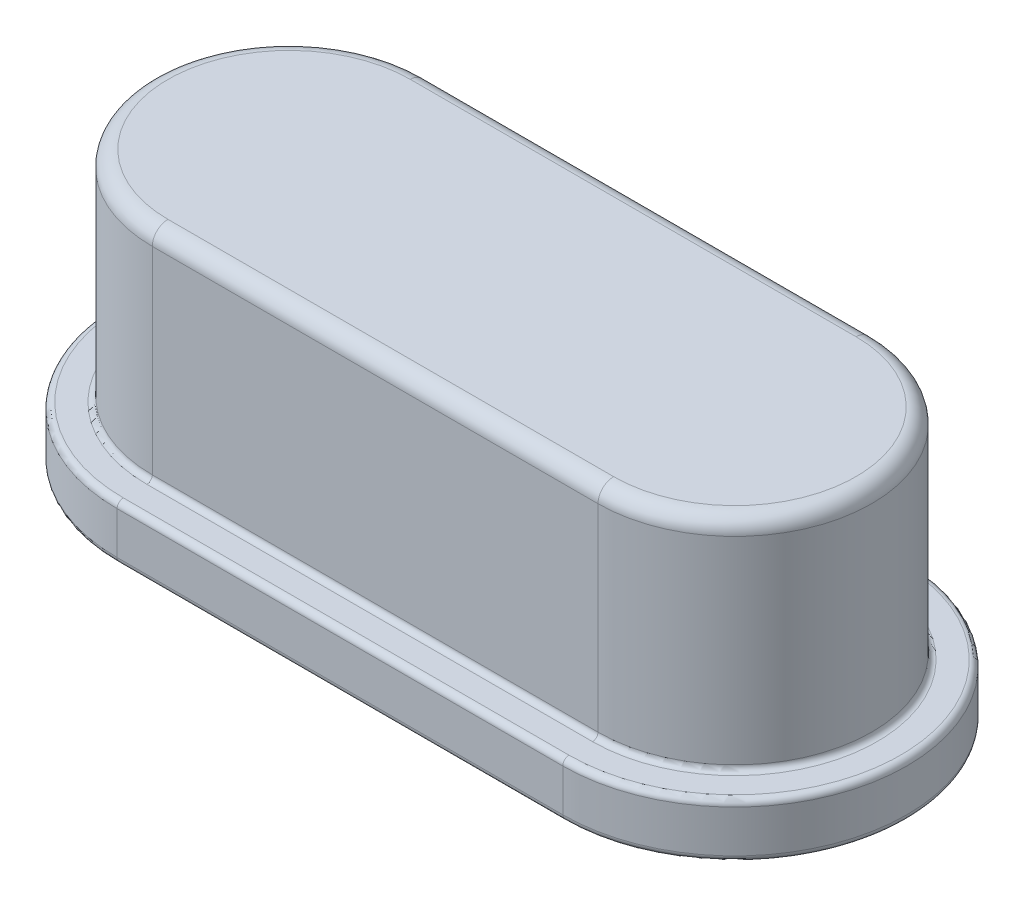
ISO-10303-21;
HEADER;
FILE_DESCRIPTION(('STEP AP214'),'2;1');
FILE_NAME('part.step','',(''),(''),'','','');
FILE_SCHEMA(('AUTOMOTIVE_DESIGN { 1 0 10303 214 1 1 1 1 }'));
ENDSEC;
DATA;
#1=APPLICATION_CONTEXT('core data for automotive mechanical design processes');
#2=APPLICATION_PROTOCOL_DEFINITION('international standard','automotive_design',2000,#1);
#3=PRODUCT_CONTEXT('',#1,'mechanical');
#4=PRODUCT('Part','Part','',(#3));
#5=PRODUCT_RELATED_PRODUCT_CATEGORY('part','',(#4));
#6=PRODUCT_DEFINITION_FORMATION('','',#4);
#7=PRODUCT_DEFINITION_CONTEXT('part definition',#1,'design');
#8=PRODUCT_DEFINITION('design','',#6,#7);
#9=PRODUCT_DEFINITION_SHAPE('','',#8);
#10=(LENGTH_UNIT() NAMED_UNIT(*) SI_UNIT(.MILLI.,.METRE.));
#11=(NAMED_UNIT(*) PLANE_ANGLE_UNIT() SI_UNIT($,.RADIAN.));
#12=(NAMED_UNIT(*) SI_UNIT($,.STERADIAN.) SOLID_ANGLE_UNIT());
#13=UNCERTAINTY_MEASURE_WITH_UNIT(LENGTH_MEASURE(1.E-05),#10,'distance_accuracy_value','');
#14=(GEOMETRIC_REPRESENTATION_CONTEXT(3) GLOBAL_UNCERTAINTY_ASSIGNED_CONTEXT((#13)) GLOBAL_UNIT_ASSIGNED_CONTEXT((#10,
#11,#12)) REPRESENTATION_CONTEXT('',''));
#15=CARTESIAN_POINT('',(0.,0.,0.));
#16=DIRECTION('',(0.,0.,1.));
#17=DIRECTION('',(1.,0.,0.));
#18=AXIS2_PLACEMENT_3D('',#15,#16,#17);
#19=CARTESIAN_POINT('',(-2.85,0.7,0.));
#20=DIRECTION('',(0.,-1.,0.));
#21=DIRECTION('',(0.,0.,-1.));
#22=AXIS2_PLACEMENT_3D('',#19,#20,#21);
#23=CYLINDRICAL_SURFACE('',#22,2.2);
#24=DIRECTION('',(0.,-1.,0.));
#25=VECTOR('',#24,1.);
#26=CARTESIAN_POINT('',(-2.85,0.7,-2.2));
#27=LINE('',#26,#25);
#28=CARTESIAN_POINT('',(-2.85,0.62,-2.2));
#29=VERTEX_POINT('',#28);
#30=CARTESIAN_POINT('',(-2.85,0.08,-2.2));
#31=VERTEX_POINT('',#30);
#32=EDGE_CURVE('E306',#29,#31,#27,.T.);
#33=ORIENTED_EDGE('',*,*,#32,.T.);
#34=CARTESIAN_POINT('',(-2.85,0.08,0.));
#35=DIRECTION('',(0.,1.,0.));
#36=DIRECTION('',(0.,0.,1.));
#37=AXIS2_PLACEMENT_3D('',#34,#35,#36);
#38=CIRCLE('',#37,2.2);
#39=CARTESIAN_POINT('',(-2.85,0.08,2.2));
#40=VERTEX_POINT('',#39);
#41=EDGE_CURVE('E206',#31,#40,#38,.T.);
#42=ORIENTED_EDGE('',*,*,#41,.T.);
#43=DIRECTION('',(0.,-1.,0.));
#44=VECTOR('',#43,1.);
#45=CARTESIAN_POINT('',(-2.85,0.7,2.2));
#46=LINE('',#45,#44);
#47=CARTESIAN_POINT('',(-2.85,0.62,2.2));
#48=VERTEX_POINT('',#47);
#49=EDGE_CURVE('E180',#48,#40,#46,.T.);
#50=ORIENTED_EDGE('',*,*,#49,.F.);
#51=CARTESIAN_POINT('',(-2.85,0.62,0.));
#52=DIRECTION('',(0.,1.,0.));
#53=DIRECTION('',(0.,0.,1.));
#54=AXIS2_PLACEMENT_3D('',#51,#52,#53);
#55=CIRCLE('',#54,2.2);
#56=EDGE_CURVE('E196',#48,#29,#55,.F.);
#57=ORIENTED_EDGE('',*,*,#56,.T.);
#58=EDGE_LOOP('',(#33,#42,#50,#57));
#59=FACE_BOUND('',#58,.T.);
#60=ADVANCED_FACE('F44',(#59),#23,.T.);
#61=CARTESIAN_POINT('',(-2.85,0.7,2.2));
#62=DIRECTION('',(0.,0.,-1.));
#63=DIRECTION('',(-1.,0.,0.));
#64=AXIS2_PLACEMENT_3D('',#61,#62,#63);
#65=PLANE('',#64);
#66=ORIENTED_EDGE('',*,*,#49,.T.);
#67=DIRECTION('',(1.,0.,0.));
#68=VECTOR('',#67,1.);
#69=CARTESIAN_POINT('',(-2.85,0.08,2.2));
#70=LINE('',#69,#68);
#71=CARTESIAN_POINT('',(2.85,0.08,2.2));
#72=VERTEX_POINT('',#71);
#73=EDGE_CURVE('E237',#40,#72,#70,.T.);
#74=ORIENTED_EDGE('',*,*,#73,.T.);
#75=DIRECTION('',(0.,-1.,0.));
#76=VECTOR('',#75,1.);
#77=CARTESIAN_POINT('',(2.85,0.7,2.2));
#78=LINE('',#77,#76);
#79=CARTESIAN_POINT('',(2.85,0.62,2.2));
#80=VERTEX_POINT('',#79);
#81=EDGE_CURVE('E318',#80,#72,#78,.T.);
#82=ORIENTED_EDGE('',*,*,#81,.F.);
#83=DIRECTION('',(1.,0.,0.));
#84=VECTOR('',#83,1.);
#85=CARTESIAN_POINT('',(-2.85,0.62,2.2));
#86=LINE('',#85,#84);
#87=EDGE_CURVE('E235',#80,#48,#86,.F.);
#88=ORIENTED_EDGE('',*,*,#87,.T.);
#89=EDGE_LOOP('',(#66,#74,#82,#88));
#90=FACE_BOUND('',#89,.T.);
#91=ADVANCED_FACE('F342',(#90),#65,.F.);
#92=CARTESIAN_POINT('',(2.85,0.7,0.));
#93=DIRECTION('',(0.,-1.,0.));
#94=DIRECTION('',(0.,0.,-1.));
#95=AXIS2_PLACEMENT_3D('',#92,#93,#94);
#96=CYLINDRICAL_SURFACE('',#95,2.2);
#97=ORIENTED_EDGE('',*,*,#81,.T.);
#98=CARTESIAN_POINT('',(2.85,0.08,0.));
#99=DIRECTION('',(0.,1.,0.));
#100=DIRECTION('',(0.,0.,1.));
#101=AXIS2_PLACEMENT_3D('',#98,#99,#100);
#102=CIRCLE('',#101,2.2);
#103=CARTESIAN_POINT('',(2.85,0.08,-2.2));
#104=VERTEX_POINT('',#103);
#105=EDGE_CURVE('E224',#72,#104,#102,.T.);
#106=ORIENTED_EDGE('',*,*,#105,.T.);
#107=DIRECTION('',(0.,-1.,0.));
#108=VECTOR('',#107,1.);
#109=CARTESIAN_POINT('',(2.85,0.7,-2.2));
#110=LINE('',#109,#108);
#111=CARTESIAN_POINT('',(2.85,0.62,-2.2));
#112=VERTEX_POINT('',#111);
#113=EDGE_CURVE('E310',#112,#104,#110,.T.);
#114=ORIENTED_EDGE('',*,*,#113,.F.);
#115=CARTESIAN_POINT('',(2.85,0.62,0.));
#116=DIRECTION('',(0.,1.,0.));
#117=DIRECTION('',(0.,0.,1.));
#118=AXIS2_PLACEMENT_3D('',#115,#116,#117);
#119=CIRCLE('',#118,2.2);
#120=EDGE_CURVE('E222',#112,#80,#119,.F.);
#121=ORIENTED_EDGE('',*,*,#120,.T.);
#122=EDGE_LOOP('',(#97,#106,#114,#121));
#123=FACE_BOUND('',#122,.T.);
#124=ADVANCED_FACE('F348',(#123),#96,.T.);
#125=CARTESIAN_POINT('',(-2.85,0.7,-2.2));
#126=DIRECTION('',(0.,0.,1.));
#127=DIRECTION('',(1.,0.,0.));
#128=AXIS2_PLACEMENT_3D('',#125,#126,#127);
#129=PLANE('',#128);
#130=ORIENTED_EDGE('',*,*,#113,.T.);
#131=DIRECTION('',(-1.,0.,0.));
#132=VECTOR('',#131,1.);
#133=CARTESIAN_POINT('',(-2.85,0.08,-2.2));
#134=LINE('',#133,#132);
#135=EDGE_CURVE('E220',#104,#31,#134,.T.);
#136=ORIENTED_EDGE('',*,*,#135,.T.);
#137=ORIENTED_EDGE('',*,*,#32,.F.);
#138=DIRECTION('',(-1.,0.,0.));
#139=VECTOR('',#138,1.);
#140=CARTESIAN_POINT('',(2.85,0.62,-2.2));
#141=LINE('',#140,#139);
#142=EDGE_CURVE('E218',#29,#112,#141,.F.);
#143=ORIENTED_EDGE('',*,*,#142,.T.);
#144=EDGE_LOOP('',(#130,#136,#137,#143));
#145=FACE_BOUND('',#144,.T.);
#146=ADVANCED_FACE('F490',(#145),#129,.F.);
#147=CARTESIAN_POINT('',(-2.85,0.7,0.));
#148=DIRECTION('',(0.,1.,0.));
#149=DIRECTION('',(0.,0.,1.));
#150=AXIS2_PLACEMENT_3D('',#147,#148,#149);
#151=PLANE('',#150);
#152=DIRECTION('',(1.,0.,0.));
#153=VECTOR('',#152,1.);
#154=CARTESIAN_POINT('',(-2.85,0.7,1.82));
#155=LINE('',#154,#153);
#156=CARTESIAN_POINT('',(2.85,0.7,1.82));
#157=VERTEX_POINT('',#156);
#158=CARTESIAN_POINT('',(-2.85,0.7,1.82));
#159=VERTEX_POINT('',#158);
#160=EDGE_CURVE('E261',#157,#159,#155,.F.);
#161=ORIENTED_EDGE('',*,*,#160,.T.);
#162=CARTESIAN_POINT('',(-2.85,0.7,0.));
#163=DIRECTION('',(0.,1.,0.));
#164=DIRECTION('',(0.,0.,1.));
#165=AXIS2_PLACEMENT_3D('',#162,#163,#164);
#166=CIRCLE('',#165,1.82);
#167=CARTESIAN_POINT('',(-2.85,0.7,-1.82));
#168=VERTEX_POINT('',#167);
#169=EDGE_CURVE('E267',#159,#168,#166,.F.);
#170=ORIENTED_EDGE('',*,*,#169,.T.);
#171=DIRECTION('',(-1.,0.,0.));
#172=VECTOR('',#171,1.);
#173=CARTESIAN_POINT('',(-2.85,0.7,-1.82));
#174=LINE('',#173,#172);
#175=CARTESIAN_POINT('',(2.85,0.7,-1.82));
#176=VERTEX_POINT('',#175);
#177=EDGE_CURVE('E265',#168,#176,#174,.F.);
#178=ORIENTED_EDGE('',*,*,#177,.T.);
#179=CARTESIAN_POINT('',(2.85,0.7,0.));
#180=DIRECTION('',(0.,1.,0.));
#181=DIRECTION('',(0.,0.,1.));
#182=AXIS2_PLACEMENT_3D('',#179,#180,#181);
#183=CIRCLE('',#182,1.82);
#184=EDGE_CURVE('E263',#176,#157,#183,.F.);
#185=ORIENTED_EDGE('',*,*,#184,.T.);
#186=EDGE_LOOP('',(#161,#170,#178,#185));
#187=FACE_BOUND('',#186,.T.);
#188=DIRECTION('',(-1.,0.,0.));
#189=VECTOR('',#188,1.);
#190=CARTESIAN_POINT('',(-2.85,0.7,-2.12));
#191=LINE('',#190,#189);
#192=CARTESIAN_POINT('',(2.85,0.7,-2.12));
#193=VERTEX_POINT('',#192);
#194=CARTESIAN_POINT('',(-2.85,0.7,-2.12));
#195=VERTEX_POINT('',#194);
#196=EDGE_CURVE('E230',#193,#195,#191,.T.);
#197=ORIENTED_EDGE('',*,*,#196,.T.);
#198=CARTESIAN_POINT('',(-2.85,0.7,0.));
#199=DIRECTION('',(0.,1.,0.));
#200=DIRECTION('',(0.,0.,1.));
#201=AXIS2_PLACEMENT_3D('',#198,#199,#200);
#202=CIRCLE('',#201,2.12);
#203=CARTESIAN_POINT('',(-2.85,0.7,2.12));
#204=VERTEX_POINT('',#203);
#205=EDGE_CURVE('E232',#195,#204,#202,.T.);
#206=ORIENTED_EDGE('',*,*,#205,.T.);
#207=DIRECTION('',(1.,0.,0.));
#208=VECTOR('',#207,1.);
#209=CARTESIAN_POINT('',(2.85,0.7,2.12));
#210=LINE('',#209,#208);
#211=CARTESIAN_POINT('',(2.85,0.7,2.12));
#212=VERTEX_POINT('',#211);
#213=EDGE_CURVE('E226',#204,#212,#210,.T.);
#214=ORIENTED_EDGE('',*,*,#213,.T.);
#215=CARTESIAN_POINT('',(2.85,0.7,0.));
#216=DIRECTION('',(0.,1.,0.));
#217=DIRECTION('',(0.,0.,1.));
#218=AXIS2_PLACEMENT_3D('',#215,#216,#217);
#219=CIRCLE('',#218,2.12);
#220=EDGE_CURVE('E228',#212,#193,#219,.T.);
#221=ORIENTED_EDGE('',*,*,#220,.T.);
#222=EDGE_LOOP('',(#197,#206,#214,#221));
#223=FACE_BOUND('',#222,.T.);
#224=ADVANCED_FACE('F291',(#187,#223),#151,.T.);
#225=CARTESIAN_POINT('',(-2.85,0.,0.));
#226=DIRECTION('',(0.,1.,0.));
#227=DIRECTION('',(0.,0.,1.));
#228=AXIS2_PLACEMENT_3D('',#225,#226,#227);
#229=PLANE('',#228);
#230=DIRECTION('',(1.,0.,0.));
#231=VECTOR('',#230,1.);
#232=CARTESIAN_POINT('',(-2.85,0.,2.12));
#233=LINE('',#232,#231);
#234=CARTESIAN_POINT('',(2.85,0.,2.12));
#235=VERTEX_POINT('',#234);
#236=CARTESIAN_POINT('',(-2.85,0.,2.12));
#237=VERTEX_POINT('',#236);
#238=EDGE_CURVE('E209',#235,#237,#233,.F.);
#239=ORIENTED_EDGE('',*,*,#238,.T.);
#240=CARTESIAN_POINT('',(-2.85,0.,0.));
#241=DIRECTION('',(0.,1.,0.));
#242=DIRECTION('',(0.,0.,1.));
#243=AXIS2_PLACEMENT_3D('',#240,#241,#242);
#244=CIRCLE('',#243,2.12);
#245=CARTESIAN_POINT('',(-2.85,0.,-2.12));
#246=VERTEX_POINT('',#245);
#247=EDGE_CURVE('E215',#237,#246,#244,.F.);
#248=ORIENTED_EDGE('',*,*,#247,.T.);
#249=DIRECTION('',(-1.,0.,0.));
#250=VECTOR('',#249,1.);
#251=CARTESIAN_POINT('',(-2.85,0.,-2.12));
#252=LINE('',#251,#250);
#253=CARTESIAN_POINT('',(2.85,0.,-2.12));
#254=VERTEX_POINT('',#253);
#255=EDGE_CURVE('E213',#246,#254,#252,.F.);
#256=ORIENTED_EDGE('',*,*,#255,.T.);
#257=CARTESIAN_POINT('',(2.85,0.,0.));
#258=DIRECTION('',(0.,1.,0.));
#259=DIRECTION('',(0.,0.,1.));
#260=AXIS2_PLACEMENT_3D('',#257,#258,#259);
#261=CIRCLE('',#260,2.12);
#262=EDGE_CURVE('E211',#254,#235,#261,.F.);
#263=ORIENTED_EDGE('',*,*,#262,.T.);
#264=EDGE_LOOP('',(#239,#248,#256,#263));
#265=FACE_BOUND('',#264,.T.);
#266=ADVANCED_FACE('F480',(#265),#229,.F.);
#267=CARTESIAN_POINT('',(-2.85,3.5,0.));
#268=DIRECTION('',(0.,-1.,0.));
#269=DIRECTION('',(0.,0.,-1.));
#270=AXIS2_PLACEMENT_3D('',#267,#268,#269);
#271=CYLINDRICAL_SURFACE('',#270,1.75);
#272=DIRECTION('',(0.,-1.,0.));
#273=VECTOR('',#272,1.);
#274=CARTESIAN_POINT('',(-2.85,3.5,-1.75));
#275=LINE('',#274,#273);
#276=CARTESIAN_POINT('',(-2.85,3.3,-1.75));
#277=VERTEX_POINT('',#276);
#278=CARTESIAN_POINT('',(-2.85,0.77,-1.75));
#279=VERTEX_POINT('',#278);
#280=EDGE_CURVE('E203',#277,#279,#275,.T.);
#281=ORIENTED_EDGE('',*,*,#280,.T.);
#282=CARTESIAN_POINT('',(-2.85,0.77,0.));
#283=DIRECTION('',(0.,1.,0.));
#284=DIRECTION('',(0.,0.,1.));
#285=AXIS2_PLACEMENT_3D('',#282,#283,#284);
#286=CIRCLE('',#285,1.75);
#287=CARTESIAN_POINT('',(-2.85,0.77,1.75));
#288=VERTEX_POINT('',#287);
#289=EDGE_CURVE('E239',#279,#288,#286,.T.);
#290=ORIENTED_EDGE('',*,*,#289,.T.);
#291=DIRECTION('',(0.,-1.,0.));
#292=VECTOR('',#291,1.);
#293=CARTESIAN_POINT('',(-2.85,3.5,1.75));
#294=LINE('',#293,#292);
#295=CARTESIAN_POINT('',(-2.85,3.3,1.75));
#296=VERTEX_POINT('',#295);
#297=EDGE_CURVE('E303',#296,#288,#294,.T.);
#298=ORIENTED_EDGE('',*,*,#297,.F.);
#299=CARTESIAN_POINT('',(-2.85,3.3,0.));
#300=DIRECTION('',(0.,1.,0.));
#301=DIRECTION('',(0.,0.,1.));
#302=AXIS2_PLACEMENT_3D('',#299,#300,#301);
#303=CIRCLE('',#302,1.75);
#304=EDGE_CURVE('E166',#296,#277,#303,.F.);
#305=ORIENTED_EDGE('',*,*,#304,.T.);
#306=EDGE_LOOP('',(#281,#290,#298,#305));
#307=FACE_BOUND('',#306,.T.);
#308=ADVANCED_FACE('F302',(#307),#271,.T.);
#309=CARTESIAN_POINT('',(-2.85,3.5,1.75));
#310=DIRECTION('',(0.,0.,-1.));
#311=DIRECTION('',(-1.,0.,0.));
#312=AXIS2_PLACEMENT_3D('',#309,#310,#311);
#313=PLANE('',#312);
#314=ORIENTED_EDGE('',*,*,#297,.T.);
#315=DIRECTION('',(1.,0.,0.));
#316=VECTOR('',#315,1.);
#317=CARTESIAN_POINT('',(-2.85,0.77,1.75));
#318=LINE('',#317,#316);
#319=CARTESIAN_POINT('',(2.85,0.77,1.75));
#320=VERTEX_POINT('',#319);
#321=EDGE_CURVE('E13',#288,#320,#318,.T.);
#322=ORIENTED_EDGE('',*,*,#321,.T.);
#323=DIRECTION('',(0.,-1.,0.));
#324=VECTOR('',#323,1.);
#325=CARTESIAN_POINT('',(2.85,3.5,1.75));
#326=LINE('',#325,#324);
#327=CARTESIAN_POINT('',(2.85,3.3,1.75));
#328=VERTEX_POINT('',#327);
#329=EDGE_CURVE('E307',#328,#320,#326,.T.);
#330=ORIENTED_EDGE('',*,*,#329,.F.);
#331=DIRECTION('',(1.,0.,0.));
#332=VECTOR('',#331,1.);
#333=CARTESIAN_POINT('',(-2.85,3.3,1.75));
#334=LINE('',#333,#332);
#335=EDGE_CURVE('E195',#328,#296,#334,.F.);
#336=ORIENTED_EDGE('',*,*,#335,.T.);
#337=EDGE_LOOP('',(#314,#322,#330,#336));
#338=FACE_BOUND('',#337,.T.);
#339=ADVANCED_FACE('F305',(#338),#313,.F.);
#340=CARTESIAN_POINT('',(2.85,3.5,0.));
#341=DIRECTION('',(0.,-1.,0.));
#342=DIRECTION('',(0.,0.,-1.));
#343=AXIS2_PLACEMENT_3D('',#340,#341,#342);
#344=CYLINDRICAL_SURFACE('',#343,1.75);
#345=ORIENTED_EDGE('',*,*,#329,.T.);
#346=CARTESIAN_POINT('',(2.85,0.77,0.));
#347=DIRECTION('',(0.,1.,0.));
#348=DIRECTION('',(0.,0.,1.));
#349=AXIS2_PLACEMENT_3D('',#346,#347,#348);
#350=CIRCLE('',#349,1.75);
#351=CARTESIAN_POINT('',(2.85,0.77,-1.75));
#352=VERTEX_POINT('',#351);
#353=EDGE_CURVE('E53',#320,#352,#350,.T.);
#354=ORIENTED_EDGE('',*,*,#353,.T.);
#355=DIRECTION('',(0.,-1.,0.));
#356=VECTOR('',#355,1.);
#357=CARTESIAN_POINT('',(2.85,3.5,-1.75));
#358=LINE('',#357,#356);
#359=CARTESIAN_POINT('',(2.85,3.3,-1.75));
#360=VERTEX_POINT('',#359);
#361=EDGE_CURVE('E312',#360,#352,#358,.T.);
#362=ORIENTED_EDGE('',*,*,#361,.F.);
#363=CARTESIAN_POINT('',(2.85,3.3,0.));
#364=DIRECTION('',(0.,1.,0.));
#365=DIRECTION('',(0.,0.,1.));
#366=AXIS2_PLACEMENT_3D('',#363,#364,#365);
#367=CIRCLE('',#366,1.75);
#368=EDGE_CURVE('E193',#360,#328,#367,.F.);
#369=ORIENTED_EDGE('',*,*,#368,.T.);
#370=EDGE_LOOP('',(#345,#354,#362,#369));
#371=FACE_BOUND('',#370,.T.);
#372=ADVANCED_FACE('F332',(#371),#344,.T.);
#373=CARTESIAN_POINT('',(-2.85,3.5,-1.75));
#374=DIRECTION('',(0.,0.,1.));
#375=DIRECTION('',(1.,0.,0.));
#376=AXIS2_PLACEMENT_3D('',#373,#374,#375);
#377=PLANE('',#376);
#378=ORIENTED_EDGE('',*,*,#361,.T.);
#379=DIRECTION('',(-1.,0.,0.));
#380=VECTOR('',#379,1.);
#381=CARTESIAN_POINT('',(-2.85,0.77,-1.75));
#382=LINE('',#381,#380);
#383=EDGE_CURVE('E270',#352,#279,#382,.T.);
#384=ORIENTED_EDGE('',*,*,#383,.T.);
#385=ORIENTED_EDGE('',*,*,#280,.F.);
#386=DIRECTION('',(-1.,0.,0.));
#387=VECTOR('',#386,1.);
#388=CARTESIAN_POINT('',(2.85,3.3,-1.75));
#389=LINE('',#388,#387);
#390=EDGE_CURVE('E187',#277,#360,#389,.F.);
#391=ORIENTED_EDGE('',*,*,#390,.T.);
#392=EDGE_LOOP('',(#378,#384,#385,#391));
#393=FACE_BOUND('',#392,.T.);
#394=ADVANCED_FACE('F330',(#393),#377,.F.);
#395=CARTESIAN_POINT('',(-2.85,3.5,0.));
#396=DIRECTION('',(0.,1.,0.));
#397=DIRECTION('',(0.,0.,1.));
#398=AXIS2_PLACEMENT_3D('',#395,#396,#397);
#399=PLANE('',#398);
#400=DIRECTION('',(-1.,0.,0.));
#401=VECTOR('',#400,1.);
#402=CARTESIAN_POINT('',(-2.85,3.5,-1.55));
#403=LINE('',#402,#401);
#404=CARTESIAN_POINT('',(2.85,3.5,-1.55));
#405=VERTEX_POINT('',#404);
#406=CARTESIAN_POINT('',(-2.85,3.5,-1.55));
#407=VERTEX_POINT('',#406);
#408=EDGE_CURVE('E184',#405,#407,#403,.T.);
#409=ORIENTED_EDGE('',*,*,#408,.T.);
#410=CARTESIAN_POINT('',(-2.85,3.5,0.));
#411=DIRECTION('',(0.,1.,0.));
#412=DIRECTION('',(0.,0.,1.));
#413=AXIS2_PLACEMENT_3D('',#410,#411,#412);
#414=CIRCLE('',#413,1.55);
#415=CARTESIAN_POINT('',(-2.85,3.5,1.55));
#416=VERTEX_POINT('',#415);
#417=EDGE_CURVE('E164',#407,#416,#414,.T.);
#418=ORIENTED_EDGE('',*,*,#417,.T.);
#419=DIRECTION('',(1.,0.,0.));
#420=VECTOR('',#419,1.);
#421=CARTESIAN_POINT('',(2.85,3.5,1.55));
#422=LINE('',#421,#420);
#423=CARTESIAN_POINT('',(2.85,3.5,1.55));
#424=VERTEX_POINT('',#423);
#425=EDGE_CURVE('E173',#416,#424,#422,.T.);
#426=ORIENTED_EDGE('',*,*,#425,.T.);
#427=CARTESIAN_POINT('',(2.85,3.5,0.));
#428=DIRECTION('',(0.,1.,0.));
#429=DIRECTION('',(0.,0.,1.));
#430=AXIS2_PLACEMENT_3D('',#427,#428,#429);
#431=CIRCLE('',#430,1.55);
#432=EDGE_CURVE('E179',#424,#405,#431,.T.);
#433=ORIENTED_EDGE('',*,*,#432,.T.);
#434=EDGE_LOOP('',(#409,#418,#426,#433));
#435=FACE_BOUND('',#434,.T.);
#436=ADVANCED_FACE('F182',(#435),#399,.T.);
#437=CARTESIAN_POINT('',(2.85,3.3,0.));
#438=DIRECTION('',(0.,1.,0.));
#439=DIRECTION('',(0.,0.,1.));
#440=AXIS2_PLACEMENT_3D('',#437,#438,#439);
#441=TOROIDAL_SURFACE('',#440,1.55,0.2);
#442=CARTESIAN_POINT('',(2.85,3.3,1.55));
#443=DIRECTION('',(-1.,0.,0.));
#444=DIRECTION('',(0.,0.,1.));
#445=AXIS2_PLACEMENT_3D('',#442,#443,#444);
#446=CIRCLE('',#445,0.2);
#447=EDGE_CURVE('E176',#328,#424,#446,.T.);
#448=ORIENTED_EDGE('',*,*,#447,.F.);
#449=ORIENTED_EDGE('',*,*,#368,.F.);
#450=CARTESIAN_POINT('',(2.85,3.3,-1.55));
#451=DIRECTION('',(-1.,0.,0.));
#452=DIRECTION('',(0.,0.,1.));
#453=AXIS2_PLACEMENT_3D('',#450,#451,#452);
#454=CIRCLE('',#453,0.2);
#455=EDGE_CURVE('E200',#405,#360,#454,.T.);
#456=ORIENTED_EDGE('',*,*,#455,.F.);
#457=ORIENTED_EDGE('',*,*,#432,.F.);
#458=EDGE_LOOP('',(#448,#449,#456,#457));
#459=FACE_BOUND('',#458,.T.);
#460=ADVANCED_FACE('F325',(#459),#441,.T.);
#461=CARTESIAN_POINT('',(-2.85,3.3,-1.55));
#462=DIRECTION('',(1.,0.,0.));
#463=DIRECTION('',(0.,0.,-1.));
#464=AXIS2_PLACEMENT_3D('',#461,#462,#463);
#465=CYLINDRICAL_SURFACE('',#464,0.2);
#466=ORIENTED_EDGE('',*,*,#455,.T.);
#467=ORIENTED_EDGE('',*,*,#390,.F.);
#468=CARTESIAN_POINT('',(-2.85,3.3,-1.55));
#469=DIRECTION('',(-1.,0.,0.));
#470=DIRECTION('',(0.,0.,1.));
#471=AXIS2_PLACEMENT_3D('',#468,#469,#470);
#472=CIRCLE('',#471,0.2);
#473=EDGE_CURVE('E169',#407,#277,#472,.T.);
#474=ORIENTED_EDGE('',*,*,#473,.F.);
#475=ORIENTED_EDGE('',*,*,#408,.F.);
#476=EDGE_LOOP('',(#466,#467,#474,#475));
#477=FACE_BOUND('',#476,.T.);
#478=ADVANCED_FACE('F328',(#477),#465,.T.);
#479=CARTESIAN_POINT('',(-2.85,3.3,1.55));
#480=DIRECTION('',(-1.,0.,0.));
#481=DIRECTION('',(0.,0.,1.));
#482=AXIS2_PLACEMENT_3D('',#479,#480,#481);
#483=CYLINDRICAL_SURFACE('',#482,0.2);
#484=ORIENTED_EDGE('',*,*,#447,.T.);
#485=ORIENTED_EDGE('',*,*,#425,.F.);
#486=CARTESIAN_POINT('',(-2.85,3.3,1.55));
#487=DIRECTION('',(-1.,0.,0.));
#488=DIRECTION('',(0.,0.,1.));
#489=AXIS2_PLACEMENT_3D('',#486,#487,#488);
#490=CIRCLE('',#489,0.2);
#491=EDGE_CURVE('E160',#296,#416,#490,.T.);
#492=ORIENTED_EDGE('',*,*,#491,.F.);
#493=ORIENTED_EDGE('',*,*,#335,.F.);
#494=EDGE_LOOP('',(#484,#485,#492,#493));
#495=FACE_BOUND('',#494,.T.);
#496=ADVANCED_FACE('F174',(#495),#483,.T.);
#497=CARTESIAN_POINT('',(-2.85,3.3,0.));
#498=DIRECTION('',(0.,1.,0.));
#499=DIRECTION('',(0.,0.,1.));
#500=AXIS2_PLACEMENT_3D('',#497,#498,#499);
#501=TOROIDAL_SURFACE('',#500,1.55,0.2);
#502=ORIENTED_EDGE('',*,*,#473,.T.);
#503=ORIENTED_EDGE('',*,*,#304,.F.);
#504=ORIENTED_EDGE('',*,*,#491,.T.);
#505=ORIENTED_EDGE('',*,*,#417,.F.);
#506=EDGE_LOOP('',(#502,#503,#504,#505));
#507=FACE_BOUND('',#506,.T.);
#508=ADVANCED_FACE('F162',(#507),#501,.T.);
#509=CARTESIAN_POINT('',(2.85,0.08,0.));
#510=DIRECTION('',(0.,1.,0.));
#511=DIRECTION('',(0.,0.,1.));
#512=AXIS2_PLACEMENT_3D('',#509,#510,#511);
#513=TOROIDAL_SURFACE('',#512,2.12,0.08);
#514=CARTESIAN_POINT('',(2.85,0.08,2.12));
#515=DIRECTION('',(-1.,0.,0.));
#516=DIRECTION('',(0.,0.,1.));
#517=AXIS2_PLACEMENT_3D('',#514,#515,#516);
#518=CIRCLE('',#517,0.08);
#519=EDGE_CURVE('E245',#235,#72,#518,.T.);
#520=ORIENTED_EDGE('',*,*,#519,.F.);
#521=ORIENTED_EDGE('',*,*,#262,.F.);
#522=CARTESIAN_POINT('',(2.85,0.08,-2.12));
#523=DIRECTION('',(-1.,0.,0.));
#524=DIRECTION('',(0.,0.,1.));
#525=AXIS2_PLACEMENT_3D('',#522,#523,#524);
#526=CIRCLE('',#525,0.08);
#527=EDGE_CURVE('E170',#104,#254,#526,.T.);
#528=ORIENTED_EDGE('',*,*,#527,.F.);
#529=ORIENTED_EDGE('',*,*,#105,.F.);
#530=EDGE_LOOP('',(#520,#521,#528,#529));
#531=FACE_BOUND('',#530,.T.);
#532=ADVANCED_FACE('F355',(#531),#513,.T.);
#533=CARTESIAN_POINT('',(-2.85,0.08,-2.12));
#534=DIRECTION('',(-1.,0.,0.));
#535=DIRECTION('',(0.,0.,1.));
#536=AXIS2_PLACEMENT_3D('',#533,#534,#535);
#537=CYLINDRICAL_SURFACE('',#536,0.08);
#538=ORIENTED_EDGE('',*,*,#527,.T.);
#539=ORIENTED_EDGE('',*,*,#255,.F.);
#540=CARTESIAN_POINT('',(-2.85,0.08,-2.12));
#541=DIRECTION('',(-1.,0.,0.));
#542=DIRECTION('',(0.,0.,1.));
#543=AXIS2_PLACEMENT_3D('',#540,#541,#542);
#544=CIRCLE('',#543,0.08);
#545=EDGE_CURVE('E242',#31,#246,#544,.T.);
#546=ORIENTED_EDGE('',*,*,#545,.F.);
#547=ORIENTED_EDGE('',*,*,#135,.F.);
#548=EDGE_LOOP('',(#538,#539,#546,#547));
#549=FACE_BOUND('',#548,.T.);
#550=ADVANCED_FACE('F370',(#549),#537,.T.);
#551=CARTESIAN_POINT('',(-2.85,0.08,2.12));
#552=DIRECTION('',(1.,0.,0.));
#553=DIRECTION('',(0.,0.,-1.));
#554=AXIS2_PLACEMENT_3D('',#551,#552,#553);
#555=CYLINDRICAL_SURFACE('',#554,0.08);
#556=ORIENTED_EDGE('',*,*,#519,.T.);
#557=ORIENTED_EDGE('',*,*,#73,.F.);
#558=CARTESIAN_POINT('',(-2.85,0.08,2.12));
#559=DIRECTION('',(-1.,0.,0.));
#560=DIRECTION('',(0.,0.,1.));
#561=AXIS2_PLACEMENT_3D('',#558,#559,#560);
#562=CIRCLE('',#561,0.08);
#563=EDGE_CURVE('E240',#237,#40,#562,.T.);
#564=ORIENTED_EDGE('',*,*,#563,.F.);
#565=ORIENTED_EDGE('',*,*,#238,.F.);
#566=EDGE_LOOP('',(#556,#557,#564,#565));
#567=FACE_BOUND('',#566,.T.);
#568=ADVANCED_FACE('F366',(#567),#555,.T.);
#569=CARTESIAN_POINT('',(-2.85,0.08,0.));
#570=DIRECTION('',(0.,1.,0.));
#571=DIRECTION('',(0.,0.,1.));
#572=AXIS2_PLACEMENT_3D('',#569,#570,#571);
#573=TOROIDAL_SURFACE('',#572,2.12,0.08);
#574=ORIENTED_EDGE('',*,*,#545,.T.);
#575=ORIENTED_EDGE('',*,*,#247,.F.);
#576=ORIENTED_EDGE('',*,*,#563,.T.);
#577=ORIENTED_EDGE('',*,*,#41,.F.);
#578=EDGE_LOOP('',(#574,#575,#576,#577));
#579=FACE_BOUND('',#578,.T.);
#580=ADVANCED_FACE('F362',(#579),#573,.T.);
#581=CARTESIAN_POINT('',(2.85,0.62,0.));
#582=DIRECTION('',(0.,1.,0.));
#583=DIRECTION('',(0.,0.,1.));
#584=AXIS2_PLACEMENT_3D('',#581,#582,#583);
#585=TOROIDAL_SURFACE('',#584,2.12,0.08);
#586=CARTESIAN_POINT('',(2.85,0.62,2.12));
#587=DIRECTION('',(-1.,0.,0.));
#588=DIRECTION('',(0.,0.,1.));
#589=AXIS2_PLACEMENT_3D('',#586,#587,#588);
#590=CIRCLE('',#589,0.08);
#591=EDGE_CURVE('E254',#80,#212,#590,.T.);
#592=ORIENTED_EDGE('',*,*,#591,.F.);
#593=ORIENTED_EDGE('',*,*,#120,.F.);
#594=CARTESIAN_POINT('',(2.85,0.62,-2.12));
#595=DIRECTION('',(-1.,0.,0.));
#596=DIRECTION('',(0.,0.,1.));
#597=AXIS2_PLACEMENT_3D('',#594,#595,#596);
#598=CIRCLE('',#597,0.08);
#599=EDGE_CURVE('E243',#193,#112,#598,.T.);
#600=ORIENTED_EDGE('',*,*,#599,.F.);
#601=ORIENTED_EDGE('',*,*,#220,.F.);
#602=EDGE_LOOP('',(#592,#593,#600,#601));
#603=FACE_BOUND('',#602,.T.);
#604=ADVANCED_FACE('F365',(#603),#585,.T.);
#605=CARTESIAN_POINT('',(-2.85,0.62,-2.12));
#606=DIRECTION('',(1.,0.,0.));
#607=DIRECTION('',(0.,0.,-1.));
#608=AXIS2_PLACEMENT_3D('',#605,#606,#607);
#609=CYLINDRICAL_SURFACE('',#608,0.08);
#610=ORIENTED_EDGE('',*,*,#599,.T.);
#611=ORIENTED_EDGE('',*,*,#142,.F.);
#612=CARTESIAN_POINT('',(-2.85,0.62,-2.12));
#613=DIRECTION('',(-1.,0.,0.));
#614=DIRECTION('',(0.,0.,1.));
#615=AXIS2_PLACEMENT_3D('',#612,#613,#614);
#616=CIRCLE('',#615,0.08);
#617=EDGE_CURVE('E252',#195,#29,#616,.T.);
#618=ORIENTED_EDGE('',*,*,#617,.F.);
#619=ORIENTED_EDGE('',*,*,#196,.F.);
#620=EDGE_LOOP('',(#610,#611,#618,#619));
#621=FACE_BOUND('',#620,.T.);
#622=ADVANCED_FACE('F385',(#621),#609,.T.);
#623=CARTESIAN_POINT('',(-2.85,0.62,2.12));
#624=DIRECTION('',(-1.,0.,0.));
#625=DIRECTION('',(0.,0.,1.));
#626=AXIS2_PLACEMENT_3D('',#623,#624,#625);
#627=CYLINDRICAL_SURFACE('',#626,0.08);
#628=ORIENTED_EDGE('',*,*,#591,.T.);
#629=ORIENTED_EDGE('',*,*,#213,.F.);
#630=CARTESIAN_POINT('',(-2.85,0.62,2.12));
#631=DIRECTION('',(-1.,0.,0.));
#632=DIRECTION('',(0.,0.,1.));
#633=AXIS2_PLACEMENT_3D('',#630,#631,#632);
#634=CIRCLE('',#633,0.08);
#635=EDGE_CURVE('E250',#48,#204,#634,.T.);
#636=ORIENTED_EDGE('',*,*,#635,.F.);
#637=ORIENTED_EDGE('',*,*,#87,.F.);
#638=EDGE_LOOP('',(#628,#629,#636,#637));
#639=FACE_BOUND('',#638,.T.);
#640=ADVANCED_FACE('F381',(#639),#627,.T.);
#641=CARTESIAN_POINT('',(-2.85,0.62,0.));
#642=DIRECTION('',(0.,1.,0.));
#643=DIRECTION('',(0.,0.,1.));
#644=AXIS2_PLACEMENT_3D('',#641,#642,#643);
#645=TOROIDAL_SURFACE('',#644,2.12,0.08);
#646=ORIENTED_EDGE('',*,*,#617,.T.);
#647=ORIENTED_EDGE('',*,*,#56,.F.);
#648=ORIENTED_EDGE('',*,*,#635,.T.);
#649=ORIENTED_EDGE('',*,*,#205,.F.);
#650=EDGE_LOOP('',(#646,#647,#648,#649));
#651=FACE_BOUND('',#650,.T.);
#652=ADVANCED_FACE('F378',(#651),#645,.T.);
#653=CARTESIAN_POINT('',(2.85,0.77,0.));
#654=DIRECTION('',(0.,1.,0.));
#655=DIRECTION('',(0.,0.,1.));
#656=AXIS2_PLACEMENT_3D('',#653,#654,#655);
#657=TOROIDAL_SURFACE('',#656,1.82,0.07);
#658=CARTESIAN_POINT('',(2.85,0.77,1.82));
#659=DIRECTION('',(1.,0.,0.));
#660=DIRECTION('',(0.,0.,-1.));
#661=AXIS2_PLACEMENT_3D('',#658,#659,#660);
#662=CIRCLE('',#661,0.07);
#663=EDGE_CURVE('E276',#157,#320,#662,.T.);
#664=ORIENTED_EDGE('',*,*,#663,.F.);
#665=ORIENTED_EDGE('',*,*,#184,.F.);
#666=CARTESIAN_POINT('',(2.85,0.77,-1.82));
#667=DIRECTION('',(1.,0.,0.));
#668=DIRECTION('',(0.,0.,-1.));
#669=AXIS2_PLACEMENT_3D('',#666,#667,#668);
#670=CIRCLE('',#669,0.07);
#671=EDGE_CURVE('E48',#352,#176,#670,.T.);
#672=ORIENTED_EDGE('',*,*,#671,.F.);
#673=ORIENTED_EDGE('',*,*,#353,.F.);
#674=EDGE_LOOP('',(#664,#665,#672,#673));
#675=FACE_BOUND('',#674,.T.);
#676=ADVANCED_FACE('F46',(#675),#657,.F.);
#677=CARTESIAN_POINT('',(-2.85,0.77,-1.82));
#678=DIRECTION('',(-1.,0.,0.));
#679=DIRECTION('',(0.,0.,1.));
#680=AXIS2_PLACEMENT_3D('',#677,#678,#679);
#681=CYLINDRICAL_SURFACE('',#680,0.07);
#682=ORIENTED_EDGE('',*,*,#671,.T.);
#683=ORIENTED_EDGE('',*,*,#177,.F.);
#684=CARTESIAN_POINT('',(-2.85,0.77,-1.82));
#685=DIRECTION('',(1.,0.,0.));
#686=DIRECTION('',(0.,0.,-1.));
#687=AXIS2_PLACEMENT_3D('',#684,#685,#686);
#688=CIRCLE('',#687,0.07);
#689=EDGE_CURVE('E275',#279,#168,#688,.T.);
#690=ORIENTED_EDGE('',*,*,#689,.F.);
#691=ORIENTED_EDGE('',*,*,#383,.F.);
#692=EDGE_LOOP('',(#682,#683,#690,#691));
#693=FACE_BOUND('',#692,.T.);
#694=ADVANCED_FACE('F286',(#693),#681,.F.);
#695=CARTESIAN_POINT('',(-2.85,0.77,1.82));
#696=DIRECTION('',(1.,0.,0.));
#697=DIRECTION('',(0.,0.,-1.));
#698=AXIS2_PLACEMENT_3D('',#695,#696,#697);
#699=CYLINDRICAL_SURFACE('',#698,0.07);
#700=ORIENTED_EDGE('',*,*,#663,.T.);
#701=ORIENTED_EDGE('',*,*,#321,.F.);
#702=CARTESIAN_POINT('',(-2.85,0.77,1.82));
#703=DIRECTION('',(1.,0.,0.));
#704=DIRECTION('',(0.,0.,-1.));
#705=AXIS2_PLACEMENT_3D('',#702,#703,#704);
#706=CIRCLE('',#705,0.07);
#707=EDGE_CURVE('E273',#159,#288,#706,.T.);
#708=ORIENTED_EDGE('',*,*,#707,.F.);
#709=ORIENTED_EDGE('',*,*,#160,.F.);
#710=EDGE_LOOP('',(#700,#701,#708,#709));
#711=FACE_BOUND('',#710,.T.);
#712=ADVANCED_FACE('F298',(#711),#699,.F.);
#713=CARTESIAN_POINT('',(-2.85,0.77,0.));
#714=DIRECTION('',(0.,1.,0.));
#715=DIRECTION('',(0.,0.,1.));
#716=AXIS2_PLACEMENT_3D('',#713,#714,#715);
#717=TOROIDAL_SURFACE('',#716,1.82,0.07);
#718=ORIENTED_EDGE('',*,*,#689,.T.);
#719=ORIENTED_EDGE('',*,*,#169,.F.);
#720=ORIENTED_EDGE('',*,*,#707,.T.);
#721=ORIENTED_EDGE('',*,*,#289,.F.);
#722=EDGE_LOOP('',(#718,#719,#720,#721));
#723=FACE_BOUND('',#722,.T.);
#724=ADVANCED_FACE('F296',(#723),#717,.F.);
#725=CLOSED_SHELL('',(#60,#91,#124,#146,#224,#266,#308,#339,#372,#394,#436,#460,#478,#496,#508,
#532,#550,#568,#580,#604,#622,#640,#652,#676,#694,#712,#724));
#726=MANIFOLD_SOLID_BREP('B2',#725);
#727=ADVANCED_BREP_SHAPE_REPRESENTATION('',(#18,#726),#14);
#728=SHAPE_DEFINITION_REPRESENTATION(#9,#727);
ENDSEC;
END-ISO-10303-21;
